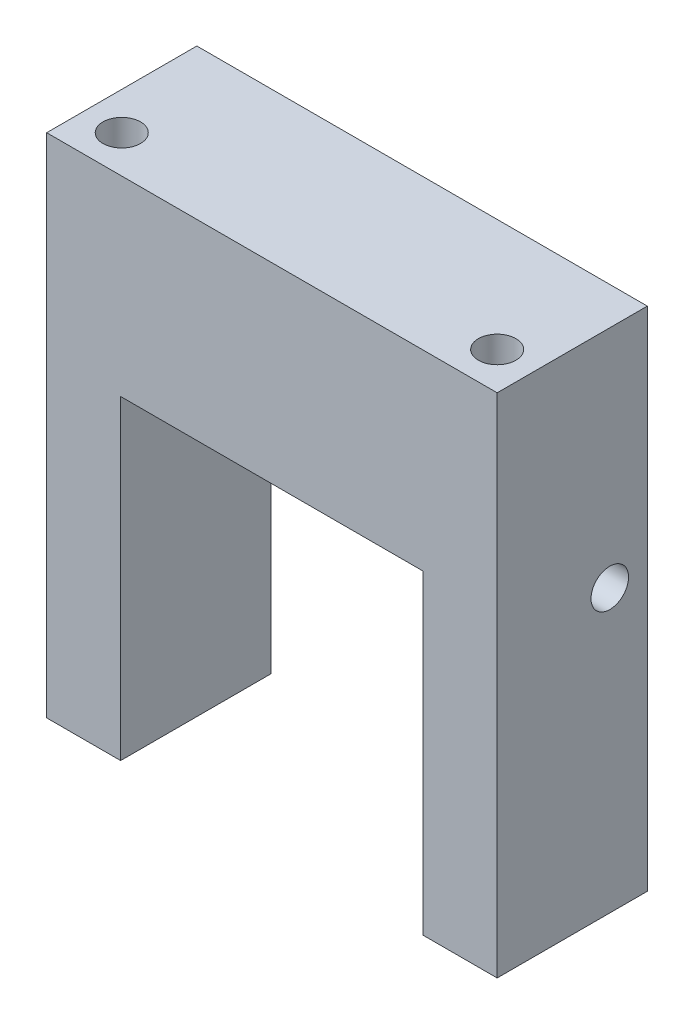
ISO-10303-21;
HEADER;
FILE_DESCRIPTION(('STEP AP214'),'2;1');
FILE_NAME('part.step','',(''),(''),'','','');
FILE_SCHEMA(('AUTOMOTIVE_DESIGN { 1 0 10303 214 1 1 1 1 }'));
ENDSEC;
DATA;
#1=APPLICATION_CONTEXT('core data for automotive mechanical design processes');
#2=APPLICATION_PROTOCOL_DEFINITION('international standard','automotive_design',2000,#1);
#3=PRODUCT_CONTEXT('',#1,'mechanical');
#4=PRODUCT('Part','Part','',(#3));
#5=PRODUCT_RELATED_PRODUCT_CATEGORY('part','',(#4));
#6=PRODUCT_DEFINITION_FORMATION('','',#4);
#7=PRODUCT_DEFINITION_CONTEXT('part definition',#1,'design');
#8=PRODUCT_DEFINITION('design','',#6,#7);
#9=PRODUCT_DEFINITION_SHAPE('','',#8);
#10=(LENGTH_UNIT() NAMED_UNIT(*) SI_UNIT(.MILLI.,.METRE.));
#11=(NAMED_UNIT(*) PLANE_ANGLE_UNIT() SI_UNIT($,.RADIAN.));
#12=(NAMED_UNIT(*) SI_UNIT($,.STERADIAN.) SOLID_ANGLE_UNIT());
#13=UNCERTAINTY_MEASURE_WITH_UNIT(LENGTH_MEASURE(1.E-05),#10,'distance_accuracy_value','');
#14=(GEOMETRIC_REPRESENTATION_CONTEXT(3) GLOBAL_UNCERTAINTY_ASSIGNED_CONTEXT((#13)) GLOBAL_UNIT_ASSIGNED_CONTEXT((#10,
#11,#12)) REPRESENTATION_CONTEXT('',''));
#15=CARTESIAN_POINT('',(0.,0.,0.));
#16=DIRECTION('',(0.,0.,1.));
#17=DIRECTION('',(1.,0.,0.));
#18=AXIS2_PLACEMENT_3D('',#15,#16,#17);
#19=CARTESIAN_POINT('',(0.,0.,20.));
#20=DIRECTION('',(1.,0.,0.));
#21=DIRECTION('',(0.,0.,-1.));
#22=AXIS2_PLACEMENT_3D('',#19,#20,#21);
#23=PLANE('',#22);
#24=CARTESIAN_POINT('',(0.,37.5,5.));
#25=DIRECTION('',(-1.,0.,0.));
#26=DIRECTION('',(0.,0.,1.));
#27=AXIS2_PLACEMENT_3D('',#24,#25,#26);
#28=CIRCLE('',#27,2.5);
#29=CARTESIAN_POINT('',(0.,37.5,7.5));
#30=VERTEX_POINT('',#29);
#31=EDGE_CURVE('E237',#30,#30,#28,.T.);
#32=ORIENTED_EDGE('',*,*,#31,.F.);
#33=EDGE_LOOP('',(#32));
#34=FACE_BOUND('',#33,.T.);
#35=DIRECTION('',(0.,-1.,0.));
#36=VECTOR('',#35,1.);
#37=CARTESIAN_POINT('',(0.,0.,0.));
#38=LINE('',#37,#36);
#39=CARTESIAN_POINT('',(0.,67.5,0.));
#40=VERTEX_POINT('',#39);
#41=CARTESIAN_POINT('',(0.,0.,0.));
#42=VERTEX_POINT('',#41);
#43=EDGE_CURVE('E146',#40,#42,#38,.T.);
#44=ORIENTED_EDGE('',*,*,#43,.T.);
#45=DIRECTION('',(0.,0.,-1.));
#46=VECTOR('',#45,1.);
#47=CARTESIAN_POINT('',(0.,0.,20.));
#48=LINE('',#47,#46);
#49=CARTESIAN_POINT('',(0.,0.,20.));
#50=VERTEX_POINT('',#49);
#51=EDGE_CURVE('E11',#50,#42,#48,.T.);
#52=ORIENTED_EDGE('',*,*,#51,.F.);
#53=DIRECTION('',(0.,-1.,0.));
#54=VECTOR('',#53,1.);
#55=CARTESIAN_POINT('',(0.,0.,20.));
#56=LINE('',#55,#54);
#57=CARTESIAN_POINT('',(0.,67.5,20.));
#58=VERTEX_POINT('',#57);
#59=EDGE_CURVE('E169',#58,#50,#56,.T.);
#60=ORIENTED_EDGE('',*,*,#59,.F.);
#61=DIRECTION('',(0.,0.,-1.));
#62=VECTOR('',#61,1.);
#63=CARTESIAN_POINT('',(0.,67.5,20.));
#64=LINE('',#63,#62);
#65=EDGE_CURVE('E142',#58,#40,#64,.T.);
#66=ORIENTED_EDGE('',*,*,#65,.T.);
#67=EDGE_LOOP('',(#44,#52,#60,#66));
#68=FACE_BOUND('',#67,.T.);
#69=ADVANCED_FACE('F45',(#34,#68),#23,.F.);
#70=CARTESIAN_POINT('',(0.,0.,20.));
#71=DIRECTION('',(0.,1.,0.));
#72=DIRECTION('',(0.,0.,1.));
#73=AXIS2_PLACEMENT_3D('',#70,#71,#72);
#74=PLANE('',#73);
#75=CARTESIAN_POINT('',(5.,0.,15.));
#76=DIRECTION('',(0.,-1.,0.));
#77=DIRECTION('',(0.,0.,-1.));
#78=AXIS2_PLACEMENT_3D('',#75,#76,#77);
#79=CIRCLE('',#78,2.5);
#80=CARTESIAN_POINT('',(5.,0.,12.5));
#81=VERTEX_POINT('',#80);
#82=EDGE_CURVE('E222',#81,#81,#79,.T.);
#83=ORIENTED_EDGE('',*,*,#82,.F.);
#84=EDGE_LOOP('',(#83));
#85=FACE_BOUND('',#84,.T.);
#86=DIRECTION('',(1.,0.,0.));
#87=VECTOR('',#86,1.);
#88=CARTESIAN_POINT('',(0.,0.,0.));
#89=LINE('',#88,#87);
#90=CARTESIAN_POINT('',(9.85,0.,0.));
#91=VERTEX_POINT('',#90);
#92=EDGE_CURVE('E150',#42,#91,#89,.T.);
#93=ORIENTED_EDGE('',*,*,#92,.T.);
#94=DIRECTION('',(0.,0.,-1.));
#95=VECTOR('',#94,1.);
#96=CARTESIAN_POINT('',(9.85,0.,20.));
#97=LINE('',#96,#95);
#98=CARTESIAN_POINT('',(9.85,0.,20.));
#99=VERTEX_POINT('',#98);
#100=EDGE_CURVE('E54',#99,#91,#97,.T.);
#101=ORIENTED_EDGE('',*,*,#100,.F.);
#102=DIRECTION('',(1.,0.,0.));
#103=VECTOR('',#102,1.);
#104=CARTESIAN_POINT('',(0.,0.,20.));
#105=LINE('',#104,#103);
#106=EDGE_CURVE('E105',#50,#99,#105,.T.);
#107=ORIENTED_EDGE('',*,*,#106,.F.);
#108=ORIENTED_EDGE('',*,*,#51,.T.);
#109=EDGE_LOOP('',(#93,#101,#107,#108));
#110=FACE_BOUND('',#109,.T.);
#111=ADVANCED_FACE('F266',(#85,#110),#74,.F.);
#112=CARTESIAN_POINT('',(9.85,0.,20.));
#113=DIRECTION('',(-1.,0.,0.));
#114=DIRECTION('',(0.,0.,1.));
#115=AXIS2_PLACEMENT_3D('',#112,#113,#114);
#116=PLANE('',#115);
#117=CARTESIAN_POINT('',(9.85,37.5,5.));
#118=DIRECTION('',(-1.,0.,0.));
#119=DIRECTION('',(0.,0.,1.));
#120=AXIS2_PLACEMENT_3D('',#117,#118,#119);
#121=CIRCLE('',#120,2.5);
#122=CARTESIAN_POINT('',(9.85,37.5,7.5));
#123=VERTEX_POINT('',#122);
#124=EDGE_CURVE('E218',#123,#123,#121,.T.);
#125=ORIENTED_EDGE('',*,*,#124,.T.);
#126=EDGE_LOOP('',(#125));
#127=FACE_BOUND('',#126,.T.);
#128=DIRECTION('',(0.,1.,0.));
#129=VECTOR('',#128,1.);
#130=CARTESIAN_POINT('',(9.85,0.,0.));
#131=LINE('',#130,#129);
#132=CARTESIAN_POINT('',(9.85,42.,0.));
#133=VERTEX_POINT('',#132);
#134=EDGE_CURVE('E154',#91,#133,#131,.T.);
#135=ORIENTED_EDGE('',*,*,#134,.T.);
#136=DIRECTION('',(0.,0.,-1.));
#137=VECTOR('',#136,1.);
#138=CARTESIAN_POINT('',(9.85,42.,20.));
#139=LINE('',#138,#137);
#140=CARTESIAN_POINT('',(9.85,42.,20.));
#141=VERTEX_POINT('',#140);
#142=EDGE_CURVE('E180',#141,#133,#139,.T.);
#143=ORIENTED_EDGE('',*,*,#142,.F.);
#144=DIRECTION('',(0.,1.,0.));
#145=VECTOR('',#144,1.);
#146=CARTESIAN_POINT('',(9.85,0.,20.));
#147=LINE('',#146,#145);
#148=EDGE_CURVE('E190',#99,#141,#147,.T.);
#149=ORIENTED_EDGE('',*,*,#148,.F.);
#150=ORIENTED_EDGE('',*,*,#100,.T.);
#151=EDGE_LOOP('',(#135,#143,#149,#150));
#152=FACE_BOUND('',#151,.T.);
#153=ADVANCED_FACE('F188',(#127,#152),#116,.F.);
#154=CARTESIAN_POINT('',(9.85,42.,20.));
#155=DIRECTION('',(0.,1.,0.));
#156=DIRECTION('',(0.,0.,1.));
#157=AXIS2_PLACEMENT_3D('',#154,#155,#156);
#158=PLANE('',#157);
#159=DIRECTION('',(1.,0.,0.));
#160=VECTOR('',#159,1.);
#161=CARTESIAN_POINT('',(9.85,42.,0.));
#162=LINE('',#161,#160);
#163=CARTESIAN_POINT('',(50.15,42.,0.));
#164=VERTEX_POINT('',#163);
#165=EDGE_CURVE('E157',#133,#164,#162,.T.);
#166=ORIENTED_EDGE('',*,*,#165,.T.);
#167=DIRECTION('',(0.,0.,-1.));
#168=VECTOR('',#167,1.);
#169=CARTESIAN_POINT('',(50.15,42.,20.));
#170=LINE('',#169,#168);
#171=CARTESIAN_POINT('',(50.15,42.,20.));
#172=VERTEX_POINT('',#171);
#173=EDGE_CURVE('E176',#172,#164,#170,.T.);
#174=ORIENTED_EDGE('',*,*,#173,.F.);
#175=DIRECTION('',(1.,0.,0.));
#176=VECTOR('',#175,1.);
#177=CARTESIAN_POINT('',(9.85,42.,20.));
#178=LINE('',#177,#176);
#179=EDGE_CURVE('E203',#141,#172,#178,.T.);
#180=ORIENTED_EDGE('',*,*,#179,.F.);
#181=ORIENTED_EDGE('',*,*,#142,.T.);
#182=EDGE_LOOP('',(#166,#174,#180,#181));
#183=FACE_BOUND('',#182,.T.);
#184=ADVANCED_FACE('F198',(#183),#158,.F.);
#185=CARTESIAN_POINT('',(50.15,0.,20.));
#186=DIRECTION('',(1.,0.,0.));
#187=DIRECTION('',(0.,0.,-1.));
#188=AXIS2_PLACEMENT_3D('',#185,#186,#187);
#189=PLANE('',#188);
#190=CARTESIAN_POINT('',(50.15,37.5,5.));
#191=DIRECTION('',(1.,0.,0.));
#192=DIRECTION('',(0.,0.,-1.));
#193=AXIS2_PLACEMENT_3D('',#190,#191,#192);
#194=CIRCLE('',#193,2.5);
#195=CARTESIAN_POINT('',(50.15,37.5,2.5));
#196=VERTEX_POINT('',#195);
#197=EDGE_CURVE('E232',#196,#196,#194,.T.);
#198=ORIENTED_EDGE('',*,*,#197,.T.);
#199=EDGE_LOOP('',(#198));
#200=FACE_BOUND('',#199,.T.);
#201=DIRECTION('',(0.,-1.,0.));
#202=VECTOR('',#201,1.);
#203=CARTESIAN_POINT('',(50.15,0.,0.));
#204=LINE('',#203,#202);
#205=CARTESIAN_POINT('',(50.15,0.,0.));
#206=VERTEX_POINT('',#205);
#207=EDGE_CURVE('E160',#164,#206,#204,.T.);
#208=ORIENTED_EDGE('',*,*,#207,.T.);
#209=DIRECTION('',(0.,0.,-1.));
#210=VECTOR('',#209,1.);
#211=CARTESIAN_POINT('',(50.15,0.,20.));
#212=LINE('',#211,#210);
#213=CARTESIAN_POINT('',(50.15,0.,20.));
#214=VERTEX_POINT('',#213);
#215=EDGE_CURVE('E135',#214,#206,#212,.T.);
#216=ORIENTED_EDGE('',*,*,#215,.F.);
#217=DIRECTION('',(0.,-1.,0.));
#218=VECTOR('',#217,1.);
#219=CARTESIAN_POINT('',(50.15,0.,20.));
#220=LINE('',#219,#218);
#221=EDGE_CURVE('E124',#172,#214,#220,.T.);
#222=ORIENTED_EDGE('',*,*,#221,.F.);
#223=ORIENTED_EDGE('',*,*,#173,.T.);
#224=EDGE_LOOP('',(#208,#216,#222,#223));
#225=FACE_BOUND('',#224,.T.);
#226=ADVANCED_FACE('F201',(#200,#225),#189,.F.);
#227=CARTESIAN_POINT('',(50.15,0.,20.));
#228=DIRECTION('',(0.,1.,0.));
#229=DIRECTION('',(0.,0.,1.));
#230=AXIS2_PLACEMENT_3D('',#227,#228,#229);
#231=PLANE('',#230);
#232=CARTESIAN_POINT('',(55.,0.,15.));
#233=DIRECTION('',(0.,-1.,0.));
#234=DIRECTION('',(0.,0.,-1.));
#235=AXIS2_PLACEMENT_3D('',#232,#233,#234);
#236=CIRCLE('',#235,2.5);
#237=CARTESIAN_POINT('',(55.,0.,12.5));
#238=VERTEX_POINT('',#237);
#239=EDGE_CURVE('E217',#238,#238,#236,.T.);
#240=ORIENTED_EDGE('',*,*,#239,.F.);
#241=EDGE_LOOP('',(#240));
#242=FACE_BOUND('',#241,.T.);
#243=DIRECTION('',(1.,0.,0.));
#244=VECTOR('',#243,1.);
#245=CARTESIAN_POINT('',(50.15,0.,0.));
#246=LINE('',#245,#244);
#247=CARTESIAN_POINT('',(60.,0.,0.));
#248=VERTEX_POINT('',#247);
#249=EDGE_CURVE('E133',#206,#248,#246,.T.);
#250=ORIENTED_EDGE('',*,*,#249,.T.);
#251=DIRECTION('',(0.,0.,-1.));
#252=VECTOR('',#251,1.);
#253=CARTESIAN_POINT('',(60.,0.,20.));
#254=LINE('',#253,#252);
#255=CARTESIAN_POINT('',(60.,0.,20.));
#256=VERTEX_POINT('',#255);
#257=EDGE_CURVE('E130',#256,#248,#254,.T.);
#258=ORIENTED_EDGE('',*,*,#257,.F.);
#259=DIRECTION('',(1.,0.,0.));
#260=VECTOR('',#259,1.);
#261=CARTESIAN_POINT('',(50.15,0.,20.));
#262=LINE('',#261,#260);
#263=EDGE_CURVE('E118',#214,#256,#262,.T.);
#264=ORIENTED_EDGE('',*,*,#263,.F.);
#265=ORIENTED_EDGE('',*,*,#215,.T.);
#266=EDGE_LOOP('',(#250,#258,#264,#265));
#267=FACE_BOUND('',#266,.T.);
#268=ADVANCED_FACE('F131',(#242,#267),#231,.F.);
#269=CARTESIAN_POINT('',(60.,0.,20.));
#270=DIRECTION('',(-1.,0.,0.));
#271=DIRECTION('',(0.,0.,1.));
#272=AXIS2_PLACEMENT_3D('',#269,#270,#271);
#273=PLANE('',#272);
#274=CARTESIAN_POINT('',(60.,37.5,5.));
#275=DIRECTION('',(-1.,0.,0.));
#276=DIRECTION('',(0.,0.,1.));
#277=AXIS2_PLACEMENT_3D('',#274,#275,#276);
#278=CIRCLE('',#277,2.5);
#279=CARTESIAN_POINT('',(60.,37.5,7.5));
#280=VERTEX_POINT('',#279);
#281=EDGE_CURVE('E236',#280,#280,#278,.T.);
#282=ORIENTED_EDGE('',*,*,#281,.T.);
#283=EDGE_LOOP('',(#282));
#284=FACE_BOUND('',#283,.T.);
#285=DIRECTION('',(0.,1.,0.));
#286=VECTOR('',#285,1.);
#287=CARTESIAN_POINT('',(60.,0.,0.));
#288=LINE('',#287,#286);
#289=CARTESIAN_POINT('',(60.,67.5,0.));
#290=VERTEX_POINT('',#289);
#291=EDGE_CURVE('E91',#248,#290,#288,.T.);
#292=ORIENTED_EDGE('',*,*,#291,.T.);
#293=DIRECTION('',(0.,0.,-1.));
#294=VECTOR('',#293,1.);
#295=CARTESIAN_POINT('',(60.,67.5,20.));
#296=LINE('',#295,#294);
#297=CARTESIAN_POINT('',(60.,67.5,20.));
#298=VERTEX_POINT('',#297);
#299=EDGE_CURVE('E136',#298,#290,#296,.T.);
#300=ORIENTED_EDGE('',*,*,#299,.F.);
#301=DIRECTION('',(0.,1.,0.));
#302=VECTOR('',#301,1.);
#303=CARTESIAN_POINT('',(60.,0.,20.));
#304=LINE('',#303,#302);
#305=EDGE_CURVE('E122',#256,#298,#304,.T.);
#306=ORIENTED_EDGE('',*,*,#305,.F.);
#307=ORIENTED_EDGE('',*,*,#257,.T.);
#308=EDGE_LOOP('',(#292,#300,#306,#307));
#309=FACE_BOUND('',#308,.T.);
#310=ADVANCED_FACE('F138',(#284,#309),#273,.F.);
#311=CARTESIAN_POINT('',(0.,67.5,20.));
#312=DIRECTION('',(0.,-1.,0.));
#313=DIRECTION('',(0.,0.,-1.));
#314=AXIS2_PLACEMENT_3D('',#311,#312,#313);
#315=PLANE('',#314);
#316=CARTESIAN_POINT('',(5.,67.5,15.));
#317=DIRECTION('',(0.,-1.,0.));
#318=DIRECTION('',(0.,0.,-1.));
#319=AXIS2_PLACEMENT_3D('',#316,#317,#318);
#320=CIRCLE('',#319,2.5);
#321=CARTESIAN_POINT('',(5.,67.5,12.5));
#322=VERTEX_POINT('',#321);
#323=EDGE_CURVE('E151',#322,#322,#320,.T.);
#324=ORIENTED_EDGE('',*,*,#323,.T.);
#325=EDGE_LOOP('',(#324));
#326=FACE_BOUND('',#325,.T.);
#327=CARTESIAN_POINT('',(55.,67.5,15.));
#328=DIRECTION('',(0.,-1.,0.));
#329=DIRECTION('',(0.,0.,-1.));
#330=AXIS2_PLACEMENT_3D('',#327,#328,#329);
#331=CIRCLE('',#330,2.5);
#332=CARTESIAN_POINT('',(55.,67.5,12.5));
#333=VERTEX_POINT('',#332);
#334=EDGE_CURVE('E213',#333,#333,#331,.T.);
#335=ORIENTED_EDGE('',*,*,#334,.T.);
#336=EDGE_LOOP('',(#335));
#337=FACE_BOUND('',#336,.T.);
#338=DIRECTION('',(-1.,0.,0.));
#339=VECTOR('',#338,1.);
#340=CARTESIAN_POINT('',(0.,67.5,0.));
#341=LINE('',#340,#339);
#342=EDGE_CURVE('E97',#290,#40,#341,.T.);
#343=ORIENTED_EDGE('',*,*,#342,.T.);
#344=ORIENTED_EDGE('',*,*,#65,.F.);
#345=DIRECTION('',(-1.,0.,0.));
#346=VECTOR('',#345,1.);
#347=CARTESIAN_POINT('',(0.,67.5,20.));
#348=LINE('',#347,#346);
#349=EDGE_CURVE('E62',#298,#58,#348,.T.);
#350=ORIENTED_EDGE('',*,*,#349,.F.);
#351=ORIENTED_EDGE('',*,*,#299,.T.);
#352=EDGE_LOOP('',(#343,#344,#350,#351));
#353=FACE_BOUND('',#352,.T.);
#354=ADVANCED_FACE('F277',(#326,#337,#353),#315,.F.);
#355=CARTESIAN_POINT('',(0.,0.,20.));
#356=DIRECTION('',(0.,0.,-1.));
#357=DIRECTION('',(-1.,0.,0.));
#358=AXIS2_PLACEMENT_3D('',#355,#356,#357);
#359=PLANE('',#358);
#360=ORIENTED_EDGE('',*,*,#59,.T.);
#361=ORIENTED_EDGE('',*,*,#106,.T.);
#362=ORIENTED_EDGE('',*,*,#148,.T.);
#363=ORIENTED_EDGE('',*,*,#179,.T.);
#364=ORIENTED_EDGE('',*,*,#221,.T.);
#365=ORIENTED_EDGE('',*,*,#263,.T.);
#366=ORIENTED_EDGE('',*,*,#305,.T.);
#367=ORIENTED_EDGE('',*,*,#349,.T.);
#368=EDGE_LOOP('',(#360,#361,#362,#363,#364,#365,#366,#367));
#369=FACE_BOUND('',#368,.T.);
#370=ADVANCED_FACE('F120',(#369),#359,.F.);
#371=CARTESIAN_POINT('',(0.,0.,0.));
#372=DIRECTION('',(0.,0.,-1.));
#373=DIRECTION('',(-1.,0.,0.));
#374=AXIS2_PLACEMENT_3D('',#371,#372,#373);
#375=PLANE('',#374);
#376=ORIENTED_EDGE('',*,*,#43,.F.);
#377=ORIENTED_EDGE('',*,*,#342,.F.);
#378=ORIENTED_EDGE('',*,*,#291,.F.);
#379=ORIENTED_EDGE('',*,*,#249,.F.);
#380=ORIENTED_EDGE('',*,*,#207,.F.);
#381=ORIENTED_EDGE('',*,*,#165,.F.);
#382=ORIENTED_EDGE('',*,*,#134,.F.);
#383=ORIENTED_EDGE('',*,*,#92,.F.);
#384=EDGE_LOOP('',(#376,#377,#378,#379,#380,#381,#382,#383));
#385=FACE_BOUND('',#384,.T.);
#386=ADVANCED_FACE('F194',(#385),#375,.T.);
#387=CARTESIAN_POINT('',(55.,67.5,15.));
#388=DIRECTION('',(0.,-1.,0.));
#389=DIRECTION('',(0.,0.,-1.));
#390=AXIS2_PLACEMENT_3D('',#387,#388,#389);
#391=CYLINDRICAL_SURFACE('',#390,2.5);
#392=ORIENTED_EDGE('',*,*,#334,.F.);
#393=EDGE_LOOP('',(#392));
#394=FACE_BOUND('',#393,.T.);
#395=ORIENTED_EDGE('',*,*,#239,.T.);
#396=EDGE_LOOP('',(#395));
#397=FACE_BOUND('',#396,.T.);
#398=ADVANCED_FACE('F290',(#394,#397),#391,.F.);
#399=CARTESIAN_POINT('',(5.,67.5,15.));
#400=DIRECTION('',(0.,-1.,0.));
#401=DIRECTION('',(0.,0.,-1.));
#402=AXIS2_PLACEMENT_3D('',#399,#400,#401);
#403=CYLINDRICAL_SURFACE('',#402,2.5);
#404=ORIENTED_EDGE('',*,*,#323,.F.);
#405=EDGE_LOOP('',(#404));
#406=FACE_BOUND('',#405,.T.);
#407=ORIENTED_EDGE('',*,*,#82,.T.);
#408=EDGE_LOOP('',(#407));
#409=FACE_BOUND('',#408,.T.);
#410=ADVANCED_FACE('F250',(#406,#409),#403,.F.);
#411=CARTESIAN_POINT('',(60.,37.5,5.));
#412=DIRECTION('',(-1.,0.,0.));
#413=DIRECTION('',(0.,0.,1.));
#414=AXIS2_PLACEMENT_3D('',#411,#412,#413);
#415=CYLINDRICAL_SURFACE('',#414,2.5);
#416=ORIENTED_EDGE('',*,*,#281,.F.);
#417=EDGE_LOOP('',(#416));
#418=FACE_BOUND('',#417,.T.);
#419=ORIENTED_EDGE('',*,*,#197,.F.);
#420=EDGE_LOOP('',(#419));
#421=FACE_BOUND('',#420,.T.);
#422=ADVANCED_FACE('F246',(#418,#421),#415,.F.);
#423=ORIENTED_EDGE('',*,*,#31,.T.);
#424=EDGE_LOOP('',(#423));
#425=FACE_BOUND('',#424,.T.);
#426=ORIENTED_EDGE('',*,*,#124,.F.);
#427=EDGE_LOOP('',(#426));
#428=FACE_BOUND('',#427,.T.);
#429=ADVANCED_FACE('F249',(#425,#428),#415,.F.);
#430=CLOSED_SHELL('',(#69,#111,#153,#184,#226,#268,#310,#354,#370,#386,#398,#410,#422,#429));
#431=MANIFOLD_SOLID_BREP('B2',#430);
#432=ADVANCED_BREP_SHAPE_REPRESENTATION('',(#18,#431),#14);
#433=SHAPE_DEFINITION_REPRESENTATION(#9,#432);
ENDSEC;
END-ISO-10303-21;
